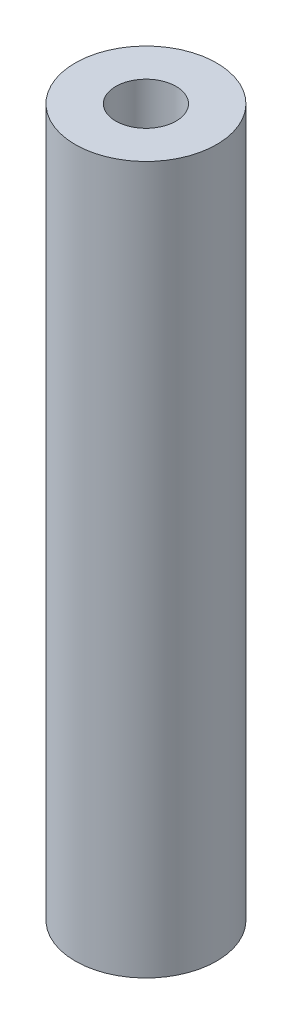
ISO-10303-21;
HEADER;
FILE_DESCRIPTION(('STEP AP214'),'2;1');
FILE_NAME('part.step','',(''),(''),'','','');
FILE_SCHEMA(('AUTOMOTIVE_DESIGN { 1 0 10303 214 1 1 1 1 }'));
ENDSEC;
DATA;
#1=APPLICATION_CONTEXT('core data for automotive mechanical design processes');
#2=APPLICATION_PROTOCOL_DEFINITION('international standard','automotive_design',2000,#1);
#3=PRODUCT_CONTEXT('',#1,'mechanical');
#4=PRODUCT('Part','Part','',(#3));
#5=PRODUCT_RELATED_PRODUCT_CATEGORY('part','',(#4));
#6=PRODUCT_DEFINITION_FORMATION('','',#4);
#7=PRODUCT_DEFINITION_CONTEXT('part definition',#1,'design');
#8=PRODUCT_DEFINITION('design','',#6,#7);
#9=PRODUCT_DEFINITION_SHAPE('','',#8);
#10=(LENGTH_UNIT() NAMED_UNIT(*) SI_UNIT(.MILLI.,.METRE.));
#11=(NAMED_UNIT(*) PLANE_ANGLE_UNIT() SI_UNIT($,.RADIAN.));
#12=(NAMED_UNIT(*) SI_UNIT($,.STERADIAN.) SOLID_ANGLE_UNIT());
#13=UNCERTAINTY_MEASURE_WITH_UNIT(LENGTH_MEASURE(1.E-05),#10,'distance_accuracy_value','');
#14=(GEOMETRIC_REPRESENTATION_CONTEXT(3) GLOBAL_UNCERTAINTY_ASSIGNED_CONTEXT((#13)) GLOBAL_UNIT_ASSIGNED_CONTEXT((#10,
#11,#12)) REPRESENTATION_CONTEXT('',''));
#15=CARTESIAN_POINT('',(0.,0.,0.));
#16=DIRECTION('',(0.,0.,1.));
#17=DIRECTION('',(1.,0.,0.));
#18=AXIS2_PLACEMENT_3D('',#15,#16,#17);
#19=CARTESIAN_POINT('',(0.,31.75,0.));
#20=DIRECTION('',(0.,-1.,0.));
#21=DIRECTION('',(0.,0.,-1.));
#22=AXIS2_PLACEMENT_3D('',#19,#20,#21);
#23=CYLINDRICAL_SURFACE('',#22,3.175);
#24=CARTESIAN_POINT('',(0.,31.75,0.));
#25=DIRECTION('',(0.,1.,0.));
#26=DIRECTION('',(0.,0.,1.));
#27=AXIS2_PLACEMENT_3D('',#24,#25,#26);
#28=CIRCLE('',#27,3.175);
#29=CARTESIAN_POINT('',(0.,31.75,3.175));
#30=VERTEX_POINT('',#29);
#31=EDGE_CURVE('E10',#30,#30,#28,.T.);
#32=ORIENTED_EDGE('',*,*,#31,.F.);
#33=EDGE_LOOP('',(#32));
#34=FACE_BOUND('',#33,.T.);
#35=CARTESIAN_POINT('',(0.,0.,0.));
#36=DIRECTION('',(0.,1.,0.));
#37=DIRECTION('',(0.,0.,1.));
#38=AXIS2_PLACEMENT_3D('',#35,#36,#37);
#39=CIRCLE('',#38,3.175);
#40=CARTESIAN_POINT('',(0.,0.,3.175));
#41=VERTEX_POINT('',#40);
#42=EDGE_CURVE('E34',#41,#41,#39,.T.);
#43=ORIENTED_EDGE('',*,*,#42,.T.);
#44=EDGE_LOOP('',(#43));
#45=FACE_BOUND('',#44,.T.);
#46=ADVANCED_FACE('F31',(#34,#45),#23,.T.);
#47=CARTESIAN_POINT('',(0.,31.75,0.));
#48=DIRECTION('',(0.,1.,0.));
#49=DIRECTION('',(0.,0.,1.));
#50=AXIS2_PLACEMENT_3D('',#47,#48,#49);
#51=PLANE('',#50);
#52=CARTESIAN_POINT('',(0.,31.75,0.));
#53=DIRECTION('',(0.,1.,0.));
#54=DIRECTION('',(0.,0.,1.));
#55=AXIS2_PLACEMENT_3D('',#52,#53,#54);
#56=CIRCLE('',#55,1.35254999999999);
#57=CARTESIAN_POINT('',(0.,31.75,1.35254999999999));
#58=VERTEX_POINT('',#57);
#59=EDGE_CURVE('E45',#58,#58,#56,.T.);
#60=ORIENTED_EDGE('',*,*,#59,.F.);
#61=EDGE_LOOP('',(#60));
#62=FACE_BOUND('',#61,.T.);
#63=ORIENTED_EDGE('',*,*,#31,.T.);
#64=EDGE_LOOP('',(#63));
#65=FACE_BOUND('',#64,.T.);
#66=ADVANCED_FACE('F51',(#62,#65),#51,.T.);
#67=CARTESIAN_POINT('',(0.,0.,0.));
#68=DIRECTION('',(0.,1.,0.));
#69=DIRECTION('',(0.,0.,1.));
#70=AXIS2_PLACEMENT_3D('',#67,#68,#69);
#71=PLANE('',#70);
#72=CARTESIAN_POINT('',(0.,0.,0.));
#73=DIRECTION('',(0.,1.,0.));
#74=DIRECTION('',(0.,0.,1.));
#75=AXIS2_PLACEMENT_3D('',#72,#73,#74);
#76=CIRCLE('',#75,1.35254999999999);
#77=CARTESIAN_POINT('',(0.,0.,1.35254999999999));
#78=VERTEX_POINT('',#77);
#79=EDGE_CURVE('E41',#78,#78,#76,.T.);
#80=ORIENTED_EDGE('',*,*,#79,.T.);
#81=EDGE_LOOP('',(#80));
#82=FACE_BOUND('',#81,.T.);
#83=ORIENTED_EDGE('',*,*,#42,.F.);
#84=EDGE_LOOP('',(#83));
#85=FACE_BOUND('',#84,.T.);
#86=ADVANCED_FACE('F53',(#82,#85),#71,.F.);
#87=CARTESIAN_POINT('',(0.,31.75,0.));
#88=DIRECTION('',(0.,1.,0.));
#89=DIRECTION('',(0.,0.,1.));
#90=AXIS2_PLACEMENT_3D('',#87,#88,#89);
#91=CYLINDRICAL_SURFACE('',#90,1.35254999999999);
#92=ORIENTED_EDGE('',*,*,#79,.F.);
#93=EDGE_LOOP('',(#92));
#94=FACE_BOUND('',#93,.T.);
#95=ORIENTED_EDGE('',*,*,#59,.T.);
#96=EDGE_LOOP('',(#95));
#97=FACE_BOUND('',#96,.T.);
#98=ADVANCED_FACE('F49',(#94,#97),#91,.F.);
#99=CLOSED_SHELL('',(#46,#66,#86,#98));
#100=MANIFOLD_SOLID_BREP('B2',#99);
#101=ADVANCED_BREP_SHAPE_REPRESENTATION('',(#18,#100),#14);
#102=SHAPE_DEFINITION_REPRESENTATION(#9,#101);
ENDSEC;
END-ISO-10303-21;
